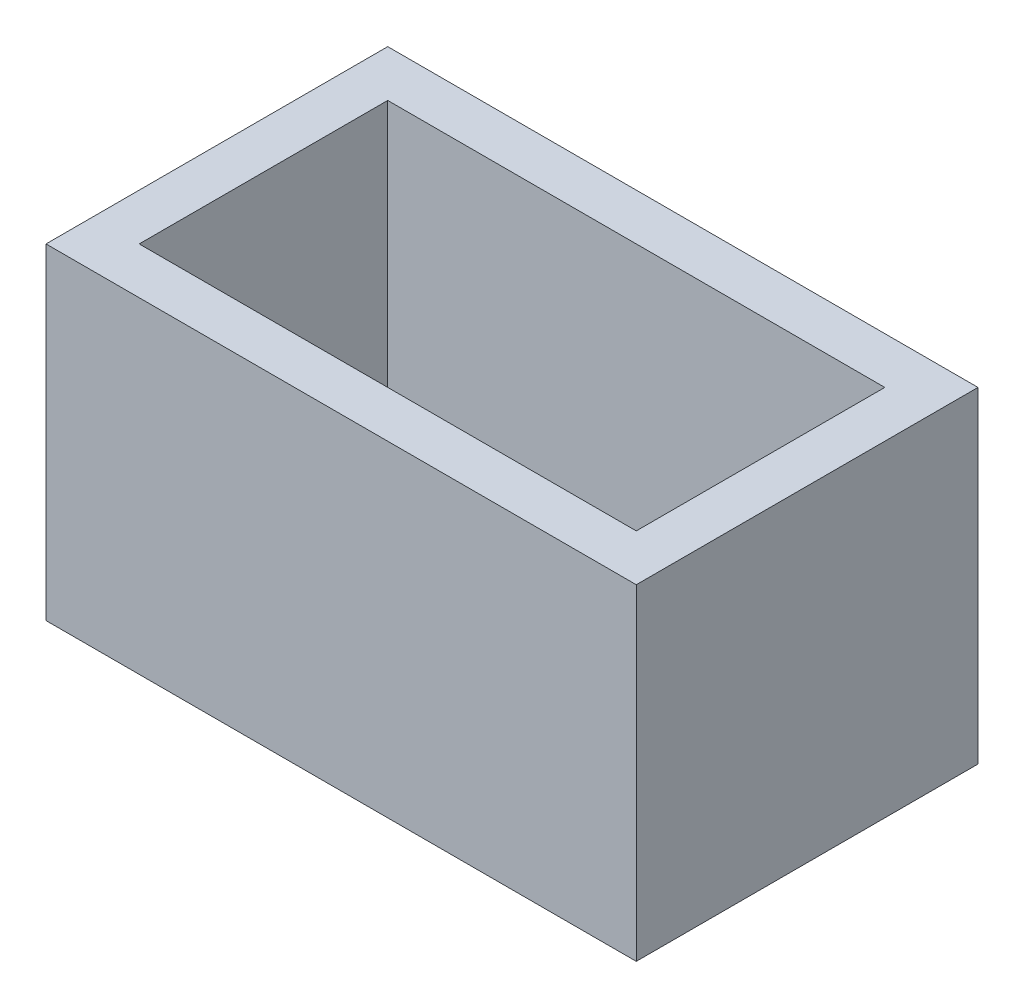
ISO-10303-21;
HEADER;
FILE_DESCRIPTION(('STEP AP214'),'2;1');
FILE_NAME('part.step','',(''),(''),'','','');
FILE_SCHEMA(('AUTOMOTIVE_DESIGN { 1 0 10303 214 1 1 1 1 }'));
ENDSEC;
DATA;
#1=APPLICATION_CONTEXT('core data for automotive mechanical design processes');
#2=APPLICATION_PROTOCOL_DEFINITION('international standard','automotive_design',2000,#1);
#3=PRODUCT_CONTEXT('',#1,'mechanical');
#4=PRODUCT('Part','Part','',(#3));
#5=PRODUCT_RELATED_PRODUCT_CATEGORY('part','',(#4));
#6=PRODUCT_DEFINITION_FORMATION('','',#4);
#7=PRODUCT_DEFINITION_CONTEXT('part definition',#1,'design');
#8=PRODUCT_DEFINITION('design','',#6,#7);
#9=PRODUCT_DEFINITION_SHAPE('','',#8);
#10=(LENGTH_UNIT() NAMED_UNIT(*) SI_UNIT(.MILLI.,.METRE.));
#11=(NAMED_UNIT(*) PLANE_ANGLE_UNIT() SI_UNIT($,.RADIAN.));
#12=(NAMED_UNIT(*) SI_UNIT($,.STERADIAN.) SOLID_ANGLE_UNIT());
#13=UNCERTAINTY_MEASURE_WITH_UNIT(LENGTH_MEASURE(1.E-05),#10,'distance_accuracy_value','');
#14=(GEOMETRIC_REPRESENTATION_CONTEXT(3) GLOBAL_UNCERTAINTY_ASSIGNED_CONTEXT((#13)) GLOBAL_UNIT_ASSIGNED_CONTEXT((#10,
#11,#12)) REPRESENTATION_CONTEXT('',''));
#15=CARTESIAN_POINT('',(0.,0.,0.));
#16=DIRECTION('',(0.,0.,1.));
#17=DIRECTION('',(1.,0.,0.));
#18=AXIS2_PLACEMENT_3D('',#15,#16,#17);
#19=CARTESIAN_POINT('',(6.,10.,-7.27));
#20=DIRECTION('',(0.,-1.,0.));
#21=DIRECTION('',(0.,0.,-1.));
#22=AXIS2_PLACEMENT_3D('',#19,#20,#21);
#23=CYLINDRICAL_SURFACE('',#22,0.625);
#24=CARTESIAN_POINT('',(6.,2.,-7.27));
#25=DIRECTION('',(0.,-1.,0.));
#26=DIRECTION('',(0.,0.,-1.));
#27=AXIS2_PLACEMENT_3D('',#24,#25,#26);
#28=CIRCLE('',#27,0.625);
#29=CARTESIAN_POINT('',(6.,2.,-7.895));
#30=VERTEX_POINT('',#29);
#31=EDGE_CURVE('E180',#30,#30,#28,.T.);
#32=ORIENTED_EDGE('',*,*,#31,.F.);
#33=EDGE_LOOP('',(#32));
#34=FACE_BOUND('',#33,.T.);
#35=CARTESIAN_POINT('',(6.,0.5,-7.27));
#36=DIRECTION('',(0.,-1.,0.));
#37=DIRECTION('',(0.,0.,-1.));
#38=AXIS2_PLACEMENT_3D('',#35,#36,#37);
#39=CIRCLE('',#38,0.625);
#40=CARTESIAN_POINT('',(6.,0.5,-7.895));
#41=VERTEX_POINT('',#40);
#42=EDGE_CURVE('E207',#41,#41,#39,.F.);
#43=ORIENTED_EDGE('',*,*,#42,.F.);
#44=EDGE_LOOP('',(#43));
#45=FACE_BOUND('',#44,.T.);
#46=ADVANCED_FACE('F42',(#34,#45),#23,.F.);
#47=CARTESIAN_POINT('',(6.,10.,-4.73));
#48=DIRECTION('',(0.,-1.,0.));
#49=DIRECTION('',(0.,0.,-1.));
#50=AXIS2_PLACEMENT_3D('',#47,#48,#49);
#51=CYLINDRICAL_SURFACE('',#50,0.625);
#52=CARTESIAN_POINT('',(6.,2.,-4.73));
#53=DIRECTION('',(0.,-1.,0.));
#54=DIRECTION('',(0.,0.,-1.));
#55=AXIS2_PLACEMENT_3D('',#52,#53,#54);
#56=CIRCLE('',#55,0.625);
#57=CARTESIAN_POINT('',(6.,2.,-5.355));
#58=VERTEX_POINT('',#57);
#59=EDGE_CURVE('E146',#58,#58,#56,.T.);
#60=ORIENTED_EDGE('',*,*,#59,.F.);
#61=EDGE_LOOP('',(#60));
#62=FACE_BOUND('',#61,.T.);
#63=CARTESIAN_POINT('',(6.,0.5,-4.73));
#64=DIRECTION('',(0.,-1.,0.));
#65=DIRECTION('',(0.,0.,-1.));
#66=AXIS2_PLACEMENT_3D('',#63,#64,#65);
#67=CIRCLE('',#66,0.625);
#68=CARTESIAN_POINT('',(6.,0.5,-5.355));
#69=VERTEX_POINT('',#68);
#70=EDGE_CURVE('E211',#69,#69,#67,.F.);
#71=ORIENTED_EDGE('',*,*,#70,.F.);
#72=EDGE_LOOP('',(#71));
#73=FACE_BOUND('',#72,.T.);
#74=ADVANCED_FACE('F245',(#62,#73),#51,.F.);
#75=CARTESIAN_POINT('',(14.,10.,-7.27));
#76=DIRECTION('',(0.,-1.,0.));
#77=DIRECTION('',(0.,0.,-1.));
#78=AXIS2_PLACEMENT_3D('',#75,#76,#77);
#79=CYLINDRICAL_SURFACE('',#78,0.625);
#80=CARTESIAN_POINT('',(14.,2.,-7.27));
#81=DIRECTION('',(0.,-1.,0.));
#82=DIRECTION('',(0.,0.,-1.));
#83=AXIS2_PLACEMENT_3D('',#80,#81,#82);
#84=CIRCLE('',#83,0.625);
#85=CARTESIAN_POINT('',(14.,2.,-7.895));
#86=VERTEX_POINT('',#85);
#87=EDGE_CURVE('E186',#86,#86,#84,.T.);
#88=ORIENTED_EDGE('',*,*,#87,.F.);
#89=EDGE_LOOP('',(#88));
#90=FACE_BOUND('',#89,.T.);
#91=CARTESIAN_POINT('',(14.,0.5,-7.27));
#92=DIRECTION('',(0.,-1.,0.));
#93=DIRECTION('',(0.,0.,-1.));
#94=AXIS2_PLACEMENT_3D('',#91,#92,#93);
#95=CIRCLE('',#94,0.625);
#96=CARTESIAN_POINT('',(14.,0.5,-7.895));
#97=VERTEX_POINT('',#96);
#98=EDGE_CURVE('E215',#97,#97,#95,.F.);
#99=ORIENTED_EDGE('',*,*,#98,.F.);
#100=EDGE_LOOP('',(#99));
#101=FACE_BOUND('',#100,.T.);
#102=ADVANCED_FACE('F251',(#90,#101),#79,.F.);
#103=CARTESIAN_POINT('',(14.,10.,-4.73));
#104=DIRECTION('',(0.,-1.,0.));
#105=DIRECTION('',(0.,0.,-1.));
#106=AXIS2_PLACEMENT_3D('',#103,#104,#105);
#107=CYLINDRICAL_SURFACE('',#106,0.625);
#108=CARTESIAN_POINT('',(14.,2.,-4.73));
#109=DIRECTION('',(0.,-1.,0.));
#110=DIRECTION('',(0.,0.,-1.));
#111=AXIS2_PLACEMENT_3D('',#108,#109,#110);
#112=CIRCLE('',#111,0.625);
#113=CARTESIAN_POINT('',(14.,2.,-5.355));
#114=VERTEX_POINT('',#113);
#115=EDGE_CURVE('E46',#114,#114,#112,.T.);
#116=ORIENTED_EDGE('',*,*,#115,.F.);
#117=EDGE_LOOP('',(#116));
#118=FACE_BOUND('',#117,.T.);
#119=CARTESIAN_POINT('',(14.,0.5,-4.73));
#120=DIRECTION('',(0.,-1.,0.));
#121=DIRECTION('',(0.,0.,-1.));
#122=AXIS2_PLACEMENT_3D('',#119,#120,#121);
#123=CIRCLE('',#122,0.625);
#124=CARTESIAN_POINT('',(14.,0.5,-5.355));
#125=VERTEX_POINT('',#124);
#126=EDGE_CURVE('E219',#125,#125,#123,.F.);
#127=ORIENTED_EDGE('',*,*,#126,.F.);
#128=EDGE_LOOP('',(#127));
#129=FACE_BOUND('',#128,.T.);
#130=ADVANCED_FACE('F295',(#118,#129),#107,.F.);
#131=CARTESIAN_POINT('',(0.5,0.,-0.5));
#132=DIRECTION('',(0.,0.,1.));
#133=DIRECTION('',(1.,0.,0.));
#134=AXIS2_PLACEMENT_3D('',#131,#132,#133);
#135=PLANE('',#134);
#136=DIRECTION('',(0.,1.,0.));
#137=VECTOR('',#136,1.);
#138=CARTESIAN_POINT('',(0.5,0.,-0.5));
#139=LINE('',#138,#137);
#140=CARTESIAN_POINT('',(0.5,0.5,-0.5));
#141=VERTEX_POINT('',#140);
#142=CARTESIAN_POINT('',(0.5,11.,-0.5));
#143=VERTEX_POINT('',#142);
#144=EDGE_CURVE('E122',#141,#143,#139,.T.);
#145=ORIENTED_EDGE('',*,*,#144,.F.);
#146=DIRECTION('',(-1.,0.,0.));
#147=VECTOR('',#146,1.);
#148=CARTESIAN_POINT('',(19.5,0.5,-0.5));
#149=LINE('',#148,#147);
#150=CARTESIAN_POINT('',(19.5,0.5,-0.5));
#151=VERTEX_POINT('',#150);
#152=EDGE_CURVE('E112',#151,#141,#149,.T.);
#153=ORIENTED_EDGE('',*,*,#152,.F.);
#154=DIRECTION('',(0.,1.,0.));
#155=VECTOR('',#154,1.);
#156=CARTESIAN_POINT('',(19.5,0.,-0.5));
#157=LINE('',#156,#155);
#158=CARTESIAN_POINT('',(19.5,11.,-0.5));
#159=VERTEX_POINT('',#158);
#160=EDGE_CURVE('E121',#151,#159,#157,.T.);
#161=ORIENTED_EDGE('',*,*,#160,.T.);
#162=DIRECTION('',(1.,0.,0.));
#163=VECTOR('',#162,1.);
#164=CARTESIAN_POINT('',(0.5,11.,-0.5));
#165=LINE('',#164,#163);
#166=EDGE_CURVE('E204',#143,#159,#165,.T.);
#167=ORIENTED_EDGE('',*,*,#166,.F.);
#168=EDGE_LOOP('',(#145,#153,#161,#167));
#169=FACE_BOUND('',#168,.T.);
#170=ADVANCED_FACE('F119',(#169),#135,.T.);
#171=CARTESIAN_POINT('',(0.5,0.,-11.5));
#172=DIRECTION('',(-1.,0.,0.));
#173=DIRECTION('',(0.,0.,1.));
#174=AXIS2_PLACEMENT_3D('',#171,#172,#173);
#175=PLANE('',#174);
#176=DIRECTION('',(0.,1.,0.));
#177=VECTOR('',#176,1.);
#178=CARTESIAN_POINT('',(0.5,0.,-11.5));
#179=LINE('',#178,#177);
#180=CARTESIAN_POINT('',(0.5,0.5,-11.5));
#181=VERTEX_POINT('',#180);
#182=CARTESIAN_POINT('',(0.5,11.,-11.5));
#183=VERTEX_POINT('',#182);
#184=EDGE_CURVE('E135',#181,#183,#179,.T.);
#185=ORIENTED_EDGE('',*,*,#184,.F.);
#186=DIRECTION('',(0.,0.,-1.));
#187=VECTOR('',#186,1.);
#188=CARTESIAN_POINT('',(0.5,0.5,-0.5));
#189=LINE('',#188,#187);
#190=EDGE_CURVE('E124',#141,#181,#189,.T.);
#191=ORIENTED_EDGE('',*,*,#190,.F.);
#192=ORIENTED_EDGE('',*,*,#144,.T.);
#193=DIRECTION('',(0.,0.,1.));
#194=VECTOR('',#193,1.);
#195=CARTESIAN_POINT('',(0.5,11.,-11.5));
#196=LINE('',#195,#194);
#197=EDGE_CURVE('E131',#183,#143,#196,.T.);
#198=ORIENTED_EDGE('',*,*,#197,.F.);
#199=EDGE_LOOP('',(#185,#191,#192,#198));
#200=FACE_BOUND('',#199,.T.);
#201=ADVANCED_FACE('F229',(#200),#175,.T.);
#202=CARTESIAN_POINT('',(19.5,0.,-11.5));
#203=DIRECTION('',(0.,0.,-1.));
#204=DIRECTION('',(-1.,0.,0.));
#205=AXIS2_PLACEMENT_3D('',#202,#203,#204);
#206=PLANE('',#205);
#207=DIRECTION('',(0.,1.,0.));
#208=VECTOR('',#207,1.);
#209=CARTESIAN_POINT('',(19.5,0.,-11.5));
#210=LINE('',#209,#208);
#211=CARTESIAN_POINT('',(19.5,0.5,-11.5));
#212=VERTEX_POINT('',#211);
#213=CARTESIAN_POINT('',(19.5,11.,-11.5));
#214=VERTEX_POINT('',#213);
#215=EDGE_CURVE('E67',#212,#214,#210,.T.);
#216=ORIENTED_EDGE('',*,*,#215,.F.);
#217=DIRECTION('',(1.,0.,0.));
#218=VECTOR('',#217,1.);
#219=CARTESIAN_POINT('',(0.5,0.5,-11.5));
#220=LINE('',#219,#218);
#221=EDGE_CURVE('E60',#181,#212,#220,.T.);
#222=ORIENTED_EDGE('',*,*,#221,.F.);
#223=ORIENTED_EDGE('',*,*,#184,.T.);
#224=DIRECTION('',(-1.,0.,0.));
#225=VECTOR('',#224,1.);
#226=CARTESIAN_POINT('',(19.5,11.,-11.5));
#227=LINE('',#226,#225);
#228=EDGE_CURVE('E138',#214,#183,#227,.T.);
#229=ORIENTED_EDGE('',*,*,#228,.F.);
#230=EDGE_LOOP('',(#216,#222,#223,#229));
#231=FACE_BOUND('',#230,.T.);
#232=ADVANCED_FACE('F228',(#231),#206,.T.);
#233=CARTESIAN_POINT('',(19.5,0.,-0.5));
#234=DIRECTION('',(1.,0.,0.));
#235=DIRECTION('',(0.,0.,-1.));
#236=AXIS2_PLACEMENT_3D('',#233,#234,#235);
#237=PLANE('',#236);
#238=ORIENTED_EDGE('',*,*,#160,.F.);
#239=DIRECTION('',(0.,0.,1.));
#240=VECTOR('',#239,1.);
#241=CARTESIAN_POINT('',(19.5,0.5,-11.5));
#242=LINE('',#241,#240);
#243=EDGE_CURVE('E108',#212,#151,#242,.T.);
#244=ORIENTED_EDGE('',*,*,#243,.F.);
#245=ORIENTED_EDGE('',*,*,#215,.T.);
#246=DIRECTION('',(0.,0.,-1.));
#247=VECTOR('',#246,1.);
#248=CARTESIAN_POINT('',(19.5,11.,-0.5));
#249=LINE('',#248,#247);
#250=EDGE_CURVE('E128',#159,#214,#249,.T.);
#251=ORIENTED_EDGE('',*,*,#250,.F.);
#252=EDGE_LOOP('',(#238,#244,#245,#251));
#253=FACE_BOUND('',#252,.T.);
#254=ADVANCED_FACE('F126',(#253),#237,.T.);
#255=CARTESIAN_POINT('',(0.,11.,0.));
#256=DIRECTION('',(0.,-1.,0.));
#257=DIRECTION('',(0.,0.,-1.));
#258=AXIS2_PLACEMENT_3D('',#255,#256,#257);
#259=PLANE('',#258);
#260=DIRECTION('',(0.,0.,1.));
#261=VECTOR('',#260,1.);
#262=CARTESIAN_POINT('',(2.,11.,0.));
#263=LINE('',#262,#261);
#264=CARTESIAN_POINT('',(2.,11.,-10.));
#265=VERTEX_POINT('',#264);
#266=CARTESIAN_POINT('',(2.,11.,-2.));
#267=VERTEX_POINT('',#266);
#268=EDGE_CURVE('E168',#265,#267,#263,.T.);
#269=ORIENTED_EDGE('',*,*,#268,.F.);
#270=DIRECTION('',(-1.,0.,0.));
#271=VECTOR('',#270,1.);
#272=CARTESIAN_POINT('',(0.,11.,-10.));
#273=LINE('',#272,#271);
#274=CARTESIAN_POINT('',(18.,11.,-10.));
#275=VERTEX_POINT('',#274);
#276=EDGE_CURVE('E153',#275,#265,#273,.T.);
#277=ORIENTED_EDGE('',*,*,#276,.F.);
#278=DIRECTION('',(0.,0.,-1.));
#279=VECTOR('',#278,1.);
#280=CARTESIAN_POINT('',(18.,11.,0.));
#281=LINE('',#280,#279);
#282=CARTESIAN_POINT('',(18.,11.,-2.));
#283=VERTEX_POINT('',#282);
#284=EDGE_CURVE('E174',#283,#275,#281,.T.);
#285=ORIENTED_EDGE('',*,*,#284,.F.);
#286=DIRECTION('',(1.,0.,0.));
#287=VECTOR('',#286,1.);
#288=CARTESIAN_POINT('',(0.,11.,-2.));
#289=LINE('',#288,#287);
#290=EDGE_CURVE('E171',#267,#283,#289,.T.);
#291=ORIENTED_EDGE('',*,*,#290,.F.);
#292=EDGE_LOOP('',(#269,#277,#285,#291));
#293=FACE_BOUND('',#292,.T.);
#294=ORIENTED_EDGE('',*,*,#166,.T.);
#295=ORIENTED_EDGE('',*,*,#250,.T.);
#296=ORIENTED_EDGE('',*,*,#228,.T.);
#297=ORIENTED_EDGE('',*,*,#197,.T.);
#298=EDGE_LOOP('',(#294,#295,#296,#297));
#299=FACE_BOUND('',#298,.T.);
#300=ADVANCED_FACE('F44',(#293,#299),#259,.F.);
#301=CARTESIAN_POINT('',(2.,11.,0.));
#302=DIRECTION('',(1.,0.,0.));
#303=DIRECTION('',(0.,0.,-1.));
#304=AXIS2_PLACEMENT_3D('',#301,#302,#303);
#305=PLANE('',#304);
#306=DIRECTION('',(0.,0.,1.));
#307=VECTOR('',#306,1.);
#308=CARTESIAN_POINT('',(2.,2.,0.));
#309=LINE('',#308,#307);
#310=CARTESIAN_POINT('',(2.,2.,-10.));
#311=VERTEX_POINT('',#310);
#312=CARTESIAN_POINT('',(2.,2.,-2.));
#313=VERTEX_POINT('',#312);
#314=EDGE_CURVE('E142',#311,#313,#309,.T.);
#315=ORIENTED_EDGE('',*,*,#314,.F.);
#316=DIRECTION('',(0.,-1.,0.));
#317=VECTOR('',#316,1.);
#318=CARTESIAN_POINT('',(2.,11.,-10.));
#319=LINE('',#318,#317);
#320=EDGE_CURVE('E148',#265,#311,#319,.T.);
#321=ORIENTED_EDGE('',*,*,#320,.F.);
#322=ORIENTED_EDGE('',*,*,#268,.T.);
#323=DIRECTION('',(0.,-1.,0.));
#324=VECTOR('',#323,1.);
#325=CARTESIAN_POINT('',(2.,11.,-2.));
#326=LINE('',#325,#324);
#327=EDGE_CURVE('E11',#267,#313,#326,.T.);
#328=ORIENTED_EDGE('',*,*,#327,.T.);
#329=EDGE_LOOP('',(#315,#321,#322,#328));
#330=FACE_BOUND('',#329,.T.);
#331=ADVANCED_FACE('F232',(#330),#305,.T.);
#332=CARTESIAN_POINT('',(0.,11.,-2.));
#333=DIRECTION('',(0.,0.,-1.));
#334=DIRECTION('',(-1.,0.,0.));
#335=AXIS2_PLACEMENT_3D('',#332,#333,#334);
#336=PLANE('',#335);
#337=DIRECTION('',(1.,0.,0.));
#338=VECTOR('',#337,1.);
#339=CARTESIAN_POINT('',(0.,2.,-2.));
#340=LINE('',#339,#338);
#341=CARTESIAN_POINT('',(18.,2.,-2.));
#342=VERTEX_POINT('',#341);
#343=EDGE_CURVE('E145',#313,#342,#340,.T.);
#344=ORIENTED_EDGE('',*,*,#343,.F.);
#345=ORIENTED_EDGE('',*,*,#327,.F.);
#346=ORIENTED_EDGE('',*,*,#290,.T.);
#347=DIRECTION('',(0.,-1.,0.));
#348=VECTOR('',#347,1.);
#349=CARTESIAN_POINT('',(18.,11.,-2.));
#350=LINE('',#349,#348);
#351=EDGE_CURVE('E52',#283,#342,#350,.T.);
#352=ORIENTED_EDGE('',*,*,#351,.T.);
#353=EDGE_LOOP('',(#344,#345,#346,#352));
#354=FACE_BOUND('',#353,.T.);
#355=ADVANCED_FACE('F239',(#354),#336,.T.);
#356=CARTESIAN_POINT('',(18.,11.,0.));
#357=DIRECTION('',(-1.,0.,0.));
#358=DIRECTION('',(0.,0.,1.));
#359=AXIS2_PLACEMENT_3D('',#356,#357,#358);
#360=PLANE('',#359);
#361=DIRECTION('',(0.,0.,-1.));
#362=VECTOR('',#361,1.);
#363=CARTESIAN_POINT('',(18.,2.,0.));
#364=LINE('',#363,#362);
#365=CARTESIAN_POINT('',(18.,2.,-10.));
#366=VERTEX_POINT('',#365);
#367=EDGE_CURVE('E156',#342,#366,#364,.T.);
#368=ORIENTED_EDGE('',*,*,#367,.F.);
#369=ORIENTED_EDGE('',*,*,#351,.F.);
#370=ORIENTED_EDGE('',*,*,#284,.T.);
#371=DIRECTION('',(0.,-1.,0.));
#372=VECTOR('',#371,1.);
#373=CARTESIAN_POINT('',(18.,11.,-10.));
#374=LINE('',#373,#372);
#375=EDGE_CURVE('E152',#275,#366,#374,.T.);
#376=ORIENTED_EDGE('',*,*,#375,.T.);
#377=EDGE_LOOP('',(#368,#369,#370,#376));
#378=FACE_BOUND('',#377,.T.);
#379=ADVANCED_FACE('F260',(#378),#360,.T.);
#380=CARTESIAN_POINT('',(0.,11.,-10.));
#381=DIRECTION('',(0.,0.,1.));
#382=DIRECTION('',(1.,0.,0.));
#383=AXIS2_PLACEMENT_3D('',#380,#381,#382);
#384=PLANE('',#383);
#385=DIRECTION('',(-1.,0.,0.));
#386=VECTOR('',#385,1.);
#387=CARTESIAN_POINT('',(0.,2.,-10.));
#388=LINE('',#387,#386);
#389=EDGE_CURVE('E162',#366,#311,#388,.T.);
#390=ORIENTED_EDGE('',*,*,#389,.F.);
#391=ORIENTED_EDGE('',*,*,#375,.F.);
#392=ORIENTED_EDGE('',*,*,#276,.T.);
#393=ORIENTED_EDGE('',*,*,#320,.T.);
#394=EDGE_LOOP('',(#390,#391,#392,#393));
#395=FACE_BOUND('',#394,.T.);
#396=ADVANCED_FACE('F264',(#395),#384,.T.);
#397=CARTESIAN_POINT('',(0.,2.,0.));
#398=DIRECTION('',(0.,-1.,0.));
#399=DIRECTION('',(0.,0.,-1.));
#400=AXIS2_PLACEMENT_3D('',#397,#398,#399);
#401=PLANE('',#400);
#402=ORIENTED_EDGE('',*,*,#115,.T.);
#403=EDGE_LOOP('',(#402));
#404=FACE_BOUND('',#403,.T.);
#405=ORIENTED_EDGE('',*,*,#87,.T.);
#406=EDGE_LOOP('',(#405));
#407=FACE_BOUND('',#406,.T.);
#408=ORIENTED_EDGE('',*,*,#59,.T.);
#409=EDGE_LOOP('',(#408));
#410=FACE_BOUND('',#409,.T.);
#411=ORIENTED_EDGE('',*,*,#31,.T.);
#412=EDGE_LOOP('',(#411));
#413=FACE_BOUND('',#412,.T.);
#414=ORIENTED_EDGE('',*,*,#314,.T.);
#415=ORIENTED_EDGE('',*,*,#343,.T.);
#416=ORIENTED_EDGE('',*,*,#367,.T.);
#417=ORIENTED_EDGE('',*,*,#389,.T.);
#418=EDGE_LOOP('',(#414,#415,#416,#417));
#419=FACE_BOUND('',#418,.T.);
#420=ADVANCED_FACE('F267',(#404,#407,#410,#413,#419),#401,.F.);
#421=CARTESIAN_POINT('',(0.,0.5,0.));
#422=DIRECTION('',(0.,-1.,0.));
#423=DIRECTION('',(0.,0.,-1.));
#424=AXIS2_PLACEMENT_3D('',#421,#422,#423);
#425=PLANE('',#424);
#426=ORIENTED_EDGE('',*,*,#221,.T.);
#427=ORIENTED_EDGE('',*,*,#243,.T.);
#428=ORIENTED_EDGE('',*,*,#152,.T.);
#429=ORIENTED_EDGE('',*,*,#190,.T.);
#430=EDGE_LOOP('',(#426,#427,#428,#429));
#431=FACE_BOUND('',#430,.T.);
#432=ORIENTED_EDGE('',*,*,#126,.T.);
#433=EDGE_LOOP('',(#432));
#434=FACE_BOUND('',#433,.T.);
#435=ORIENTED_EDGE('',*,*,#98,.T.);
#436=EDGE_LOOP('',(#435));
#437=FACE_BOUND('',#436,.T.);
#438=ORIENTED_EDGE('',*,*,#70,.T.);
#439=EDGE_LOOP('',(#438));
#440=FACE_BOUND('',#439,.T.);
#441=ORIENTED_EDGE('',*,*,#42,.T.);
#442=EDGE_LOOP('',(#441));
#443=FACE_BOUND('',#442,.T.);
#444=ADVANCED_FACE('F110',(#431,#434,#437,#440,#443),#425,.T.);
#445=CLOSED_SHELL('',(#46,#74,#102,#130,#170,#201,#232,#254,#300,#331,#355,#379,#396,#420,#444));
#446=MANIFOLD_SOLID_BREP('B2',#445);
#447=ADVANCED_BREP_SHAPE_REPRESENTATION('',(#18,#446),#14);
#448=SHAPE_DEFINITION_REPRESENTATION(#9,#447);
ENDSEC;
END-ISO-10303-21;
